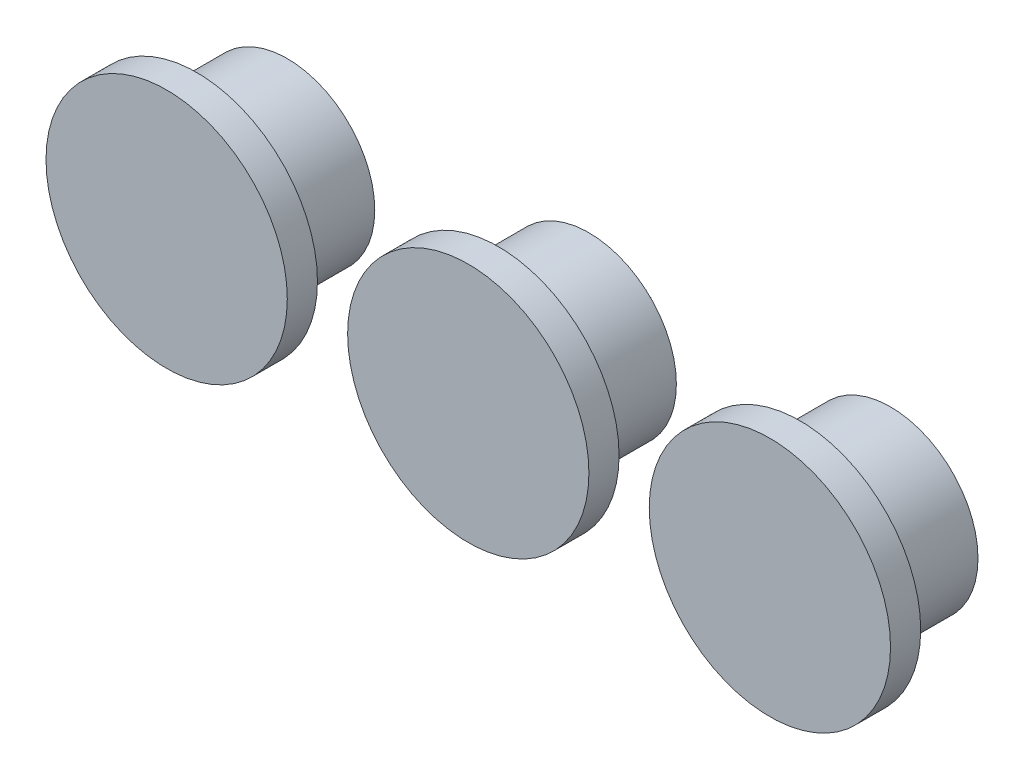
ISO-10303-21;
HEADER;
FILE_DESCRIPTION(('STEP AP214'),'2;1');
FILE_NAME('part.step','',(''),(''),'','','');
FILE_SCHEMA(('AUTOMOTIVE_DESIGN { 1 0 10303 214 1 1 1 1 }'));
ENDSEC;
DATA;
#1=APPLICATION_CONTEXT('core data for automotive mechanical design processes');
#2=APPLICATION_PROTOCOL_DEFINITION('international standard','automotive_design',2000,#1);
#3=PRODUCT_CONTEXT('',#1,'mechanical');
#4=PRODUCT('Part','Part','',(#3));
#5=PRODUCT_RELATED_PRODUCT_CATEGORY('part','',(#4));
#6=PRODUCT_DEFINITION_FORMATION('','',#4);
#7=PRODUCT_DEFINITION_CONTEXT('part definition',#1,'design');
#8=PRODUCT_DEFINITION('design','',#6,#7);
#9=PRODUCT_DEFINITION_SHAPE('','',#8);
#10=(LENGTH_UNIT() NAMED_UNIT(*) SI_UNIT(.MILLI.,.METRE.));
#11=(NAMED_UNIT(*) PLANE_ANGLE_UNIT() SI_UNIT($,.RADIAN.));
#12=(NAMED_UNIT(*) SI_UNIT($,.STERADIAN.) SOLID_ANGLE_UNIT());
#13=UNCERTAINTY_MEASURE_WITH_UNIT(LENGTH_MEASURE(1.E-05),#10,'distance_accuracy_value','');
#14=(GEOMETRIC_REPRESENTATION_CONTEXT(3) GLOBAL_UNCERTAINTY_ASSIGNED_CONTEXT((#13)) GLOBAL_UNIT_ASSIGNED_CONTEXT((#10,
#11,#12)) REPRESENTATION_CONTEXT('',''));
#15=CARTESIAN_POINT('',(0.,0.,0.));
#16=DIRECTION('',(0.,0.,1.));
#17=DIRECTION('',(1.,0.,0.));
#18=AXIS2_PLACEMENT_3D('',#15,#16,#17);
#19=CARTESIAN_POINT('',(-20.,0.,3.));
#20=DIRECTION('',(0.,0.,-1.));
#21=DIRECTION('',(-1.,0.,0.));
#22=AXIS2_PLACEMENT_3D('',#19,#20,#21);
#23=CYLINDRICAL_SURFACE('',#22,2.9);
#24=CARTESIAN_POINT('',(-20.,0.,3.));
#25=DIRECTION('',(0.,0.,1.));
#26=DIRECTION('',(1.,0.,0.));
#27=AXIS2_PLACEMENT_3D('',#24,#25,#26);
#28=CIRCLE('',#27,2.9);
#29=CARTESIAN_POINT('',(-17.1,0.,3.));
#30=VERTEX_POINT('',#29);
#31=EDGE_CURVE('E12',#30,#30,#28,.T.);
#32=ORIENTED_EDGE('',*,*,#31,.F.);
#33=EDGE_LOOP('',(#32));
#34=FACE_BOUND('',#33,.T.);
#35=CARTESIAN_POINT('',(-20.,0.,0.));
#36=DIRECTION('',(0.,0.,1.));
#37=DIRECTION('',(1.,0.,0.));
#38=AXIS2_PLACEMENT_3D('',#35,#36,#37);
#39=CIRCLE('',#38,2.9);
#40=CARTESIAN_POINT('',(-17.1,0.,0.));
#41=VERTEX_POINT('',#40);
#42=EDGE_CURVE('E47',#41,#41,#39,.T.);
#43=ORIENTED_EDGE('',*,*,#42,.T.);
#44=EDGE_LOOP('',(#43));
#45=FACE_BOUND('',#44,.T.);
#46=ADVANCED_FACE('F44',(#34,#45),#23,.T.);
#47=CARTESIAN_POINT('',(-20.,0.,0.));
#48=DIRECTION('',(0.,0.,1.));
#49=DIRECTION('',(1.,0.,0.));
#50=AXIS2_PLACEMENT_3D('',#47,#48,#49);
#51=PLANE('',#50);
#52=DIRECTION('',(-1.,0.,0.));
#53=VECTOR('',#52,1.);
#54=CARTESIAN_POINT('',(-18.8463310917722,0.363364072389241,0.));
#55=LINE('',#54,#53);
#56=CARTESIAN_POINT('',(-18.8463310917722,0.363364072389241,0.));
#57=VERTEX_POINT('',#56);
#58=CARTESIAN_POINT('',(-21.0999468453323,0.363364072389241,0.));
#59=VERTEX_POINT('',#58);
#60=EDGE_CURVE('E108',#57,#59,#55,.T.);
#61=ORIENTED_EDGE('',*,*,#60,.T.);
#62=DIRECTION('',(0.,-1.,0.));
#63=VECTOR('',#62,1.);
#64=CARTESIAN_POINT('',(-21.0999468453323,0.363364072389241,0.));
#65=LINE('',#64,#63);
#66=CARTESIAN_POINT('',(-21.0999468453323,-0.25125840585443,0.));
#67=VERTEX_POINT('',#66);
#68=EDGE_CURVE('E58',#59,#67,#65,.T.);
#69=ORIENTED_EDGE('',*,*,#68,.T.);
#70=DIRECTION('',(1.,0.,0.));
#71=VECTOR('',#70,1.);
#72=CARTESIAN_POINT('',(-21.0999468453323,-0.25125840585443,0.));
#73=LINE('',#72,#71);
#74=CARTESIAN_POINT('',(-18.8463310917722,-0.25125840585443,0.));
#75=VERTEX_POINT('',#74);
#76=EDGE_CURVE('E113',#67,#75,#73,.T.);
#77=ORIENTED_EDGE('',*,*,#76,.T.);
#78=DIRECTION('',(0.,1.,0.));
#79=VECTOR('',#78,1.);
#80=CARTESIAN_POINT('',(-18.8463310917722,-0.25125840585443,0.));
#81=LINE('',#80,#79);
#82=EDGE_CURVE('E96',#75,#57,#81,.T.);
#83=ORIENTED_EDGE('',*,*,#82,.T.);
#84=EDGE_LOOP('',(#61,#69,#77,#83));
#85=FACE_BOUND('',#84,.T.);
#86=ORIENTED_EDGE('',*,*,#42,.F.);
#87=EDGE_LOOP('',(#86));
#88=FACE_BOUND('',#87,.T.);
#89=ADVANCED_FACE('F146',(#85,#88),#51,.F.);
#90=CARTESIAN_POINT('',(-20.,0.,4.));
#91=DIRECTION('',(0.,0.,-1.));
#92=DIRECTION('',(-1.,0.,0.));
#93=AXIS2_PLACEMENT_3D('',#90,#91,#92);
#94=CYLINDRICAL_SURFACE('',#93,4.);
#95=CARTESIAN_POINT('',(-20.,0.,4.));
#96=DIRECTION('',(0.,0.,1.));
#97=DIRECTION('',(1.,0.,0.));
#98=AXIS2_PLACEMENT_3D('',#95,#96,#97);
#99=CIRCLE('',#98,4.);
#100=CARTESIAN_POINT('',(-16.,0.,4.));
#101=VERTEX_POINT('',#100);
#102=EDGE_CURVE('E122',#101,#101,#99,.T.);
#103=ORIENTED_EDGE('',*,*,#102,.F.);
#104=EDGE_LOOP('',(#103));
#105=FACE_BOUND('',#104,.T.);
#106=CARTESIAN_POINT('',(-20.,0.,3.));
#107=DIRECTION('',(0.,0.,1.));
#108=DIRECTION('',(1.,0.,0.));
#109=AXIS2_PLACEMENT_3D('',#106,#107,#108);
#110=CIRCLE('',#109,4.);
#111=CARTESIAN_POINT('',(-16.,0.,3.));
#112=VERTEX_POINT('',#111);
#113=EDGE_CURVE('E119',#112,#112,#110,.T.);
#114=ORIENTED_EDGE('',*,*,#113,.T.);
#115=EDGE_LOOP('',(#114));
#116=FACE_BOUND('',#115,.T.);
#117=ADVANCED_FACE('F128',(#105,#116),#94,.T.);
#118=CARTESIAN_POINT('',(-20.,0.,4.));
#119=DIRECTION('',(0.,0.,1.));
#120=DIRECTION('',(1.,0.,0.));
#121=AXIS2_PLACEMENT_3D('',#118,#119,#120);
#122=PLANE('',#121);
#123=ORIENTED_EDGE('',*,*,#102,.T.);
#124=EDGE_LOOP('',(#123));
#125=FACE_BOUND('',#124,.T.);
#126=ADVANCED_FACE('F133',(#125),#122,.T.);
#127=CARTESIAN_POINT('',(-20.,0.,3.));
#128=DIRECTION('',(0.,0.,1.));
#129=DIRECTION('',(1.,0.,0.));
#130=AXIS2_PLACEMENT_3D('',#127,#128,#129);
#131=PLANE('',#130);
#132=ORIENTED_EDGE('',*,*,#31,.T.);
#133=EDGE_LOOP('',(#132));
#134=FACE_BOUND('',#133,.T.);
#135=ORIENTED_EDGE('',*,*,#113,.F.);
#136=EDGE_LOOP('',(#135));
#137=FACE_BOUND('',#136,.T.);
#138=ADVANCED_FACE('F130',(#134,#137),#131,.F.);
#139=CARTESIAN_POINT('',(-21.0999468453323,0.363364072389241,-0.5));
#140=DIRECTION('',(-1.,0.,0.));
#141=DIRECTION('',(0.,0.,1.));
#142=AXIS2_PLACEMENT_3D('',#139,#140,#141);
#143=PLANE('',#142);
#144=ORIENTED_EDGE('',*,*,#68,.F.);
#145=DIRECTION('',(0.,0.,1.));
#146=VECTOR('',#145,1.);
#147=CARTESIAN_POINT('',(-21.0999468453323,0.363364072389241,-0.5));
#148=LINE('',#147,#146);
#149=CARTESIAN_POINT('',(-21.0999468453323,0.363364072389241,-0.5));
#150=VERTEX_POINT('',#149);
#151=EDGE_CURVE('E63',#150,#59,#148,.T.);
#152=ORIENTED_EDGE('',*,*,#151,.F.);
#153=DIRECTION('',(0.,-1.,0.));
#154=VECTOR('',#153,1.);
#155=CARTESIAN_POINT('',(-21.0999468453323,0.363364072389241,-0.5));
#156=LINE('',#155,#154);
#157=CARTESIAN_POINT('',(-21.0999468453323,-0.25125840585443,-0.5));
#158=VERTEX_POINT('',#157);
#159=EDGE_CURVE('E106',#150,#158,#156,.T.);
#160=ORIENTED_EDGE('',*,*,#159,.T.);
#161=DIRECTION('',(0.,0.,1.));
#162=VECTOR('',#161,1.);
#163=CARTESIAN_POINT('',(-21.0999468453323,-0.25125840585443,-0.5));
#164=LINE('',#163,#162);
#165=EDGE_CURVE('E87',#158,#67,#164,.T.);
#166=ORIENTED_EDGE('',*,*,#165,.T.);
#167=EDGE_LOOP('',(#144,#152,#160,#166));
#168=FACE_BOUND('',#167,.T.);
#169=ADVANCED_FACE('F132',(#168),#143,.T.);
#170=CARTESIAN_POINT('',(-18.8463310917722,0.363364072389241,-0.5));
#171=DIRECTION('',(0.,1.,0.));
#172=DIRECTION('',(0.,0.,1.));
#173=AXIS2_PLACEMENT_3D('',#170,#171,#172);
#174=PLANE('',#173);
#175=ORIENTED_EDGE('',*,*,#60,.F.);
#176=DIRECTION('',(0.,0.,1.));
#177=VECTOR('',#176,1.);
#178=CARTESIAN_POINT('',(-18.8463310917722,0.363364072389241,-0.5));
#179=LINE('',#178,#177);
#180=CARTESIAN_POINT('',(-18.8463310917722,0.363364072389241,-0.5));
#181=VERTEX_POINT('',#180);
#182=EDGE_CURVE('E80',#181,#57,#179,.T.);
#183=ORIENTED_EDGE('',*,*,#182,.F.);
#184=DIRECTION('',(-1.,0.,0.));
#185=VECTOR('',#184,1.);
#186=CARTESIAN_POINT('',(-18.8463310917722,0.363364072389241,-0.5));
#187=LINE('',#186,#185);
#188=EDGE_CURVE('E103',#181,#150,#187,.T.);
#189=ORIENTED_EDGE('',*,*,#188,.T.);
#190=ORIENTED_EDGE('',*,*,#151,.T.);
#191=EDGE_LOOP('',(#175,#183,#189,#190));
#192=FACE_BOUND('',#191,.T.);
#193=ADVANCED_FACE('F140',(#192),#174,.T.);
#194=CARTESIAN_POINT('',(-18.8463310917722,-0.25125840585443,-0.5));
#195=DIRECTION('',(1.,0.,0.));
#196=DIRECTION('',(0.,0.,-1.));
#197=AXIS2_PLACEMENT_3D('',#194,#195,#196);
#198=PLANE('',#197);
#199=ORIENTED_EDGE('',*,*,#82,.F.);
#200=DIRECTION('',(0.,0.,1.));
#201=VECTOR('',#200,1.);
#202=CARTESIAN_POINT('',(-18.8463310917722,-0.25125840585443,-0.5));
#203=LINE('',#202,#201);
#204=CARTESIAN_POINT('',(-18.8463310917722,-0.25125840585443,-0.5));
#205=VERTEX_POINT('',#204);
#206=EDGE_CURVE('E90',#205,#75,#203,.T.);
#207=ORIENTED_EDGE('',*,*,#206,.F.);
#208=DIRECTION('',(0.,1.,0.));
#209=VECTOR('',#208,1.);
#210=CARTESIAN_POINT('',(-18.8463310917722,-0.25125840585443,-0.5));
#211=LINE('',#210,#209);
#212=EDGE_CURVE('E93',#205,#181,#211,.T.);
#213=ORIENTED_EDGE('',*,*,#212,.T.);
#214=ORIENTED_EDGE('',*,*,#182,.T.);
#215=EDGE_LOOP('',(#199,#207,#213,#214));
#216=FACE_BOUND('',#215,.T.);
#217=ADVANCED_FACE('F92',(#216),#198,.T.);
#218=CARTESIAN_POINT('',(-21.0999468453323,-0.25125840585443,-0.5));
#219=DIRECTION('',(0.,-1.,0.));
#220=DIRECTION('',(0.,0.,-1.));
#221=AXIS2_PLACEMENT_3D('',#218,#219,#220);
#222=PLANE('',#221);
#223=ORIENTED_EDGE('',*,*,#76,.F.);
#224=ORIENTED_EDGE('',*,*,#165,.F.);
#225=DIRECTION('',(1.,0.,0.));
#226=VECTOR('',#225,1.);
#227=CARTESIAN_POINT('',(-21.0999468453323,-0.25125840585443,-0.5));
#228=LINE('',#227,#226);
#229=EDGE_CURVE('E101',#158,#205,#228,.T.);
#230=ORIENTED_EDGE('',*,*,#229,.T.);
#231=ORIENTED_EDGE('',*,*,#206,.T.);
#232=EDGE_LOOP('',(#223,#224,#230,#231));
#233=FACE_BOUND('',#232,.T.);
#234=ADVANCED_FACE('F105',(#233),#222,.T.);
#235=CARTESIAN_POINT('',(0.,0.,-0.5));
#236=DIRECTION('',(0.,0.,1.));
#237=DIRECTION('',(1.,0.,0.));
#238=AXIS2_PLACEMENT_3D('',#235,#236,#237);
#239=PLANE('',#238);
#240=ORIENTED_EDGE('',*,*,#159,.F.);
#241=ORIENTED_EDGE('',*,*,#188,.F.);
#242=ORIENTED_EDGE('',*,*,#212,.F.);
#243=ORIENTED_EDGE('',*,*,#229,.F.);
#244=EDGE_LOOP('',(#240,#241,#242,#243));
#245=FACE_BOUND('',#244,.T.);
#246=ADVANCED_FACE('F100',(#245),#239,.F.);
#247=CLOSED_SHELL('',(#46,#89,#117,#126,#138,#169,#193,#217,#234,#246));
#248=MANIFOLD_SOLID_BREP('B2',#247);
#249=CARTESIAN_POINT('',(-10.,0.,0.));
#250=DIRECTION('',(0.,0.,1.));
#251=DIRECTION('',(1.,0.,0.));
#252=AXIS2_PLACEMENT_3D('',#249,#250,#251);
#253=PLANE('',#252);
#254=CARTESIAN_POINT('',(-10.,0.,0.));
#255=DIRECTION('',(0.,0.,1.));
#256=DIRECTION('',(1.,0.,0.));
#257=AXIS2_PLACEMENT_3D('',#254,#255,#256);
#258=CIRCLE('',#257,2.9);
#259=CARTESIAN_POINT('',(-7.1,0.,0.));
#260=VERTEX_POINT('',#259);
#261=EDGE_CURVE('E241',#260,#260,#258,.T.);
#262=ORIENTED_EDGE('',*,*,#261,.F.);
#263=EDGE_LOOP('',(#262));
#264=FACE_BOUND('',#263,.T.);
#265=DIRECTION('',(0.,-1.,0.));
#266=VECTOR('',#265,1.);
#267=CARTESIAN_POINT('',(-8.44204611788897,1.55834461552597,0.));
#268=LINE('',#267,#266);
#269=CARTESIAN_POINT('',(-8.44204611788897,1.55834461552597,0.));
#270=VERTEX_POINT('',#269);
#271=CARTESIAN_POINT('',(-8.44204611788897,-1.44165538447403,0.));
#272=VERTEX_POINT('',#271);
#273=EDGE_CURVE('E252',#270,#272,#268,.T.);
#274=ORIENTED_EDGE('',*,*,#273,.F.);
#275=DIRECTION('',(1.,0.,0.));
#276=VECTOR('',#275,1.);
#277=CARTESIAN_POINT('',(-8.44204611788897,1.55834461552597,0.));
#278=LINE('',#277,#276);
#279=CARTESIAN_POINT('',(-11.442046117889,1.55834461552597,0.));
#280=VERTEX_POINT('',#279);
#281=EDGE_CURVE('E256',#280,#270,#278,.T.);
#282=ORIENTED_EDGE('',*,*,#281,.F.);
#283=DIRECTION('',(0.,1.,0.));
#284=VECTOR('',#283,1.);
#285=CARTESIAN_POINT('',(-11.442046117889,1.55834461552597,0.));
#286=LINE('',#285,#284);
#287=CARTESIAN_POINT('',(-11.442046117889,-1.44165538447403,0.));
#288=VERTEX_POINT('',#287);
#289=EDGE_CURVE('E405',#288,#280,#286,.T.);
#290=ORIENTED_EDGE('',*,*,#289,.F.);
#291=DIRECTION('',(-1.,0.,0.));
#292=VECTOR('',#291,1.);
#293=CARTESIAN_POINT('',(-8.44204611788897,-1.44165538447403,0.));
#294=LINE('',#293,#292);
#295=EDGE_CURVE('E411',#272,#288,#294,.T.);
#296=ORIENTED_EDGE('',*,*,#295,.F.);
#297=EDGE_LOOP('',(#274,#282,#290,#296));
#298=FACE_BOUND('',#297,.T.);
#299=ADVANCED_FACE('F237',(#264,#298),#253,.F.);
#300=CARTESIAN_POINT('',(-10.,0.,3.));
#301=DIRECTION('',(0.,0.,-1.));
#302=DIRECTION('',(-1.,0.,0.));
#303=AXIS2_PLACEMENT_3D('',#300,#301,#302);
#304=CYLINDRICAL_SURFACE('',#303,2.9);
#305=CARTESIAN_POINT('',(-10.,0.,3.));
#306=DIRECTION('',(0.,0.,1.));
#307=DIRECTION('',(1.,0.,0.));
#308=AXIS2_PLACEMENT_3D('',#305,#306,#307);
#309=CIRCLE('',#308,2.9);
#310=CARTESIAN_POINT('',(-7.1,0.,3.));
#311=VERTEX_POINT('',#310);
#312=EDGE_CURVE('E42',#311,#311,#309,.T.);
#313=ORIENTED_EDGE('',*,*,#312,.F.);
#314=EDGE_LOOP('',(#313));
#315=FACE_BOUND('',#314,.T.);
#316=ORIENTED_EDGE('',*,*,#261,.T.);
#317=EDGE_LOOP('',(#316));
#318=FACE_BOUND('',#317,.T.);
#319=ADVANCED_FACE('F239',(#315,#318),#304,.T.);
#320=CARTESIAN_POINT('',(-10.,0.,4.));
#321=DIRECTION('',(0.,0.,-1.));
#322=DIRECTION('',(-1.,0.,0.));
#323=AXIS2_PLACEMENT_3D('',#320,#321,#322);
#324=CYLINDRICAL_SURFACE('',#323,4.);
#325=CARTESIAN_POINT('',(-10.,0.,4.));
#326=DIRECTION('',(0.,0.,1.));
#327=DIRECTION('',(1.,0.,0.));
#328=AXIS2_PLACEMENT_3D('',#325,#326,#327);
#329=CIRCLE('',#328,4.);
#330=CARTESIAN_POINT('',(-6.,0.,4.));
#331=VERTEX_POINT('',#330);
#332=EDGE_CURVE('E301',#331,#331,#329,.T.);
#333=ORIENTED_EDGE('',*,*,#332,.F.);
#334=EDGE_LOOP('',(#333));
#335=FACE_BOUND('',#334,.T.);
#336=CARTESIAN_POINT('',(-10.,0.,3.));
#337=DIRECTION('',(0.,0.,1.));
#338=DIRECTION('',(1.,0.,0.));
#339=AXIS2_PLACEMENT_3D('',#336,#337,#338);
#340=CIRCLE('',#339,4.);
#341=CARTESIAN_POINT('',(-6.,0.,3.));
#342=VERTEX_POINT('',#341);
#343=EDGE_CURVE('E298',#342,#342,#340,.T.);
#344=ORIENTED_EDGE('',*,*,#343,.T.);
#345=EDGE_LOOP('',(#344));
#346=FACE_BOUND('',#345,.T.);
#347=ADVANCED_FACE('F320',(#335,#346),#324,.T.);
#348=CARTESIAN_POINT('',(-10.,0.,4.));
#349=DIRECTION('',(0.,0.,1.));
#350=DIRECTION('',(1.,0.,0.));
#351=AXIS2_PLACEMENT_3D('',#348,#349,#350);
#352=PLANE('',#351);
#353=ORIENTED_EDGE('',*,*,#332,.T.);
#354=EDGE_LOOP('',(#353));
#355=FACE_BOUND('',#354,.T.);
#356=ADVANCED_FACE('F325',(#355),#352,.T.);
#357=CARTESIAN_POINT('',(-10.,0.,3.));
#358=DIRECTION('',(0.,0.,1.));
#359=DIRECTION('',(1.,0.,0.));
#360=AXIS2_PLACEMENT_3D('',#357,#358,#359);
#361=PLANE('',#360);
#362=ORIENTED_EDGE('',*,*,#312,.T.);
#363=EDGE_LOOP('',(#362));
#364=FACE_BOUND('',#363,.T.);
#365=ORIENTED_EDGE('',*,*,#343,.F.);
#366=EDGE_LOOP('',(#365));
#367=FACE_BOUND('',#366,.T.);
#368=ADVANCED_FACE('F327',(#364,#367),#361,.F.);
#369=CARTESIAN_POINT('',(-8.44204611788897,1.55834461552597,-0.5));
#370=DIRECTION('',(-1.,0.,0.));
#371=DIRECTION('',(0.,0.,1.));
#372=AXIS2_PLACEMENT_3D('',#369,#370,#371);
#373=PLANE('',#372);
#374=ORIENTED_EDGE('',*,*,#273,.T.);
#375=DIRECTION('',(0.,0.,1.));
#376=VECTOR('',#375,1.);
#377=CARTESIAN_POINT('',(-8.44204611788897,-1.44165538447403,-0.5));
#378=LINE('',#377,#376);
#379=CARTESIAN_POINT('',(-8.44204611788897,-1.44165538447403,-0.5));
#380=VERTEX_POINT('',#379);
#381=EDGE_CURVE('E281',#380,#272,#378,.T.);
#382=ORIENTED_EDGE('',*,*,#381,.F.);
#383=DIRECTION('',(0.,-1.,0.));
#384=VECTOR('',#383,1.);
#385=CARTESIAN_POINT('',(-8.44204611788897,1.55834461552597,-0.5));
#386=LINE('',#385,#384);
#387=CARTESIAN_POINT('',(-8.44204611788897,1.55834461552597,-0.5));
#388=VERTEX_POINT('',#387);
#389=EDGE_CURVE('E287',#388,#380,#386,.T.);
#390=ORIENTED_EDGE('',*,*,#389,.F.);
#391=DIRECTION('',(0.,0.,1.));
#392=VECTOR('',#391,1.);
#393=CARTESIAN_POINT('',(-8.44204611788897,1.55834461552597,-0.5));
#394=LINE('',#393,#392);
#395=EDGE_CURVE('E403',#388,#270,#394,.T.);
#396=ORIENTED_EDGE('',*,*,#395,.T.);
#397=EDGE_LOOP('',(#374,#382,#390,#396));
#398=FACE_BOUND('',#397,.T.);
#399=ADVANCED_FACE('F297',(#398),#373,.F.);
#400=CARTESIAN_POINT('',(-8.44204611788897,-1.44165538447403,-0.5));
#401=DIRECTION('',(0.,1.,0.));
#402=DIRECTION('',(0.,0.,1.));
#403=AXIS2_PLACEMENT_3D('',#400,#401,#402);
#404=PLANE('',#403);
#405=ORIENTED_EDGE('',*,*,#295,.T.);
#406=DIRECTION('',(0.,0.,1.));
#407=VECTOR('',#406,1.);
#408=CARTESIAN_POINT('',(-11.442046117889,-1.44165538447403,-0.5));
#409=LINE('',#408,#407);
#410=CARTESIAN_POINT('',(-11.442046117889,-1.44165538447403,-0.5));
#411=VERTEX_POINT('',#410);
#412=EDGE_CURVE('E283',#411,#288,#409,.T.);
#413=ORIENTED_EDGE('',*,*,#412,.F.);
#414=DIRECTION('',(-1.,0.,0.));
#415=VECTOR('',#414,1.);
#416=CARTESIAN_POINT('',(-8.44204611788897,-1.44165538447403,-0.5));
#417=LINE('',#416,#415);
#418=EDGE_CURVE('E276',#380,#411,#417,.T.);
#419=ORIENTED_EDGE('',*,*,#418,.F.);
#420=ORIENTED_EDGE('',*,*,#381,.T.);
#421=EDGE_LOOP('',(#405,#413,#419,#420));
#422=FACE_BOUND('',#421,.T.);
#423=ADVANCED_FACE('F279',(#422),#404,.F.);
#424=CARTESIAN_POINT('',(-11.442046117889,1.55834461552597,-0.5));
#425=DIRECTION('',(1.,0.,0.));
#426=DIRECTION('',(0.,0.,-1.));
#427=AXIS2_PLACEMENT_3D('',#424,#425,#426);
#428=PLANE('',#427);
#429=ORIENTED_EDGE('',*,*,#289,.T.);
#430=DIRECTION('',(0.,0.,1.));
#431=VECTOR('',#430,1.);
#432=CARTESIAN_POINT('',(-11.442046117889,1.55834461552597,-0.5));
#433=LINE('',#432,#431);
#434=CARTESIAN_POINT('',(-11.442046117889,1.55834461552597,-0.5));
#435=VERTEX_POINT('',#434);
#436=EDGE_CURVE('E303',#435,#280,#433,.T.);
#437=ORIENTED_EDGE('',*,*,#436,.F.);
#438=DIRECTION('',(0.,1.,0.));
#439=VECTOR('',#438,1.);
#440=CARTESIAN_POINT('',(-11.442046117889,1.55834461552597,-0.5));
#441=LINE('',#440,#439);
#442=EDGE_CURVE('E286',#411,#435,#441,.T.);
#443=ORIENTED_EDGE('',*,*,#442,.F.);
#444=ORIENTED_EDGE('',*,*,#412,.T.);
#445=EDGE_LOOP('',(#429,#437,#443,#444));
#446=FACE_BOUND('',#445,.T.);
#447=ADVANCED_FACE('F337',(#446),#428,.F.);
#448=CARTESIAN_POINT('',(-8.44204611788897,1.55834461552597,-0.5));
#449=DIRECTION('',(0.,-1.,0.));
#450=DIRECTION('',(0.,0.,-1.));
#451=AXIS2_PLACEMENT_3D('',#448,#449,#450);
#452=PLANE('',#451);
#453=ORIENTED_EDGE('',*,*,#281,.T.);
#454=ORIENTED_EDGE('',*,*,#395,.F.);
#455=DIRECTION('',(1.,0.,0.));
#456=VECTOR('',#455,1.);
#457=CARTESIAN_POINT('',(-8.44204611788897,1.55834461552597,-0.5));
#458=LINE('',#457,#456);
#459=EDGE_CURVE('E292',#435,#388,#458,.T.);
#460=ORIENTED_EDGE('',*,*,#459,.F.);
#461=ORIENTED_EDGE('',*,*,#436,.T.);
#462=EDGE_LOOP('',(#453,#454,#460,#461));
#463=FACE_BOUND('',#462,.T.);
#464=ADVANCED_FACE('F340',(#463),#452,.F.);
#465=CARTESIAN_POINT('',(0.,0.,-0.5));
#466=DIRECTION('',(0.,0.,-1.));
#467=DIRECTION('',(-1.,0.,0.));
#468=AXIS2_PLACEMENT_3D('',#465,#466,#467);
#469=PLANE('',#468);
#470=ORIENTED_EDGE('',*,*,#389,.T.);
#471=ORIENTED_EDGE('',*,*,#418,.T.);
#472=ORIENTED_EDGE('',*,*,#442,.T.);
#473=ORIENTED_EDGE('',*,*,#459,.T.);
#474=EDGE_LOOP('',(#470,#471,#472,#473));
#475=FACE_BOUND('',#474,.T.);
#476=ADVANCED_FACE('F290',(#475),#469,.T.);
#477=CLOSED_SHELL('',(#299,#319,#347,#356,#368,#399,#423,#447,#464,#476));
#478=MANIFOLD_SOLID_BREP('B6',#477);
#479=CARTESIAN_POINT('',(0.,0.,3.));
#480=DIRECTION('',(0.,0.,-1.));
#481=DIRECTION('',(-1.,0.,0.));
#482=AXIS2_PLACEMENT_3D('',#479,#480,#481);
#483=CYLINDRICAL_SURFACE('',#482,2.9);
#484=CARTESIAN_POINT('',(0.,0.,3.));
#485=DIRECTION('',(0.,0.,1.));
#486=DIRECTION('',(1.,0.,0.));
#487=AXIS2_PLACEMENT_3D('',#484,#485,#486);
#488=CIRCLE('',#487,2.9);
#489=CARTESIAN_POINT('',(2.9,0.,3.));
#490=VERTEX_POINT('',#489);
#491=EDGE_CURVE('E235',#490,#490,#488,.T.);
#492=ORIENTED_EDGE('',*,*,#491,.F.);
#493=EDGE_LOOP('',(#492));
#494=FACE_BOUND('',#493,.T.);
#495=CARTESIAN_POINT('',(0.,0.,0.));
#496=DIRECTION('',(0.,0.,1.));
#497=DIRECTION('',(1.,0.,0.));
#498=AXIS2_PLACEMENT_3D('',#495,#496,#497);
#499=CIRCLE('',#498,2.9);
#500=CARTESIAN_POINT('',(2.9,0.,0.));
#501=VERTEX_POINT('',#500);
#502=EDGE_CURVE('E424',#501,#501,#499,.T.);
#503=ORIENTED_EDGE('',*,*,#502,.T.);
#504=EDGE_LOOP('',(#503));
#505=FACE_BOUND('',#504,.T.);
#506=ADVANCED_FACE('F421',(#494,#505),#483,.T.);
#507=CARTESIAN_POINT('',(0.,0.,0.));
#508=DIRECTION('',(0.,0.,1.));
#509=DIRECTION('',(1.,0.,0.));
#510=AXIS2_PLACEMENT_3D('',#507,#508,#509);
#511=PLANE('',#510);
#512=DIRECTION('',(-1.,0.,0.));
#513=VECTOR('',#512,1.);
#514=CARTESIAN_POINT('',(-0.362539264212914,0.189310936347937,0.));
#515=LINE('',#514,#513);
#516=CARTESIAN_POINT('',(-0.362539264212914,0.189310936347937,0.));
#517=VERTEX_POINT('',#516);
#518=CARTESIAN_POINT('',(-2.34298947188696,0.189310936347937,0.));
#519=VERTEX_POINT('',#518);
#520=EDGE_CURVE('E573',#517,#519,#515,.T.);
#521=ORIENTED_EDGE('',*,*,#520,.T.);
#522=DIRECTION('',(0.,-1.,0.));
#523=VECTOR('',#522,1.);
#524=CARTESIAN_POINT('',(-2.34298947188696,0.189310936347937,0.));
#525=LINE('',#524,#523);
#526=CARTESIAN_POINT('',(-2.34298947188696,-0.357020155424215,0.));
#527=VERTEX_POINT('',#526);
#528=EDGE_CURVE('E435',#519,#527,#525,.T.);
#529=ORIENTED_EDGE('',*,*,#528,.T.);
#530=DIRECTION('',(1.,0.,0.));
#531=VECTOR('',#530,1.);
#532=CARTESIAN_POINT('',(-2.34298947188696,-0.357020155424215,0.));
#533=LINE('',#532,#531);
#534=CARTESIAN_POINT('',(-0.362539264212914,-0.357020155424215,0.));
#535=VERTEX_POINT('',#534);
#536=EDGE_CURVE('E546',#527,#535,#533,.T.);
#537=ORIENTED_EDGE('',*,*,#536,.T.);
#538=DIRECTION('',(0.,-1.,0.));
#539=VECTOR('',#538,1.);
#540=CARTESIAN_POINT('',(-0.362539264212914,-0.357020155424215,0.));
#541=LINE('',#540,#539);
#542=CARTESIAN_POINT('',(-0.362539264212914,-2.33747036309827,0.));
#543=VERTEX_POINT('',#542);
#544=EDGE_CURVE('E549',#535,#543,#541,.T.);
#545=ORIENTED_EDGE('',*,*,#544,.T.);
#546=DIRECTION('',(1.,0.,0.));
#547=VECTOR('',#546,1.);
#548=CARTESIAN_POINT('',(-0.362539264212914,-2.33747036309827,0.));
#549=LINE('',#548,#547);
#550=CARTESIAN_POINT('',(0.252083214030757,-2.33747036309827,0.));
#551=VERTEX_POINT('',#550);
#552=EDGE_CURVE('E552',#543,#551,#549,.T.);
#553=ORIENTED_EDGE('',*,*,#552,.T.);
#554=DIRECTION('',(0.,1.,0.));
#555=VECTOR('',#554,1.);
#556=CARTESIAN_POINT('',(0.252083214030757,-2.33747036309827,0.));
#557=LINE('',#556,#555);
#558=CARTESIAN_POINT('',(0.252083214030757,-0.357020155424215,0.));
#559=VERTEX_POINT('',#558);
#560=EDGE_CURVE('E555',#551,#559,#557,.T.);
#561=ORIENTED_EDGE('',*,*,#560,.T.);
#562=DIRECTION('',(1.,0.,0.));
#563=VECTOR('',#562,1.);
#564=CARTESIAN_POINT('',(0.252083214030757,-0.357020155424215,0.));
#565=LINE('',#564,#563);
#566=CARTESIAN_POINT('',(2.23253342170481,-0.357020155424215,0.));
#567=VERTEX_POINT('',#566);
#568=EDGE_CURVE('E558',#559,#567,#565,.T.);
#569=ORIENTED_EDGE('',*,*,#568,.T.);
#570=DIRECTION('',(0.,1.,0.));
#571=VECTOR('',#570,1.);
#572=CARTESIAN_POINT('',(2.23253342170481,-0.357020155424215,0.));
#573=LINE('',#572,#571);
#574=CARTESIAN_POINT('',(2.23253342170481,0.189310936347937,0.));
#575=VERTEX_POINT('',#574);
#576=EDGE_CURVE('E561',#567,#575,#573,.T.);
#577=ORIENTED_EDGE('',*,*,#576,.T.);
#578=DIRECTION('',(-1.,0.,0.));
#579=VECTOR('',#578,1.);
#580=CARTESIAN_POINT('',(2.23253342170481,0.189310936347937,0.));
#581=LINE('',#580,#579);
#582=CARTESIAN_POINT('',(0.252083214030757,0.189310936347937,0.));
#583=VERTEX_POINT('',#582);
#584=EDGE_CURVE('E564',#575,#583,#581,.T.);
#585=ORIENTED_EDGE('',*,*,#584,.T.);
#586=DIRECTION('',(0.,1.,0.));
#587=VECTOR('',#586,1.);
#588=CARTESIAN_POINT('',(0.252083214030757,0.189310936347937,0.));
#589=LINE('',#588,#587);
#590=CARTESIAN_POINT('',(0.252083214030757,2.16976114402199,0.));
#591=VERTEX_POINT('',#590);
#592=EDGE_CURVE('E567',#583,#591,#589,.T.);
#593=ORIENTED_EDGE('',*,*,#592,.T.);
#594=DIRECTION('',(-1.,0.,0.));
#595=VECTOR('',#594,1.);
#596=CARTESIAN_POINT('',(0.252083214030757,2.16976114402199,0.));
#597=LINE('',#596,#595);
#598=CARTESIAN_POINT('',(-0.362539264212914,2.16976114402199,0.));
#599=VERTEX_POINT('',#598);
#600=EDGE_CURVE('E570',#591,#599,#597,.T.);
#601=ORIENTED_EDGE('',*,*,#600,.T.);
#602=DIRECTION('',(0.,-1.,0.));
#603=VECTOR('',#602,1.);
#604=CARTESIAN_POINT('',(-0.362539264212914,2.16976114402199,0.));
#605=LINE('',#604,#603);
#606=EDGE_CURVE('E521',#599,#517,#605,.T.);
#607=ORIENTED_EDGE('',*,*,#606,.T.);
#608=EDGE_LOOP('',(#521,#529,#537,#545,#553,#561,#569,#577,#585,#593,#601,#607));
#609=FACE_BOUND('',#608,.T.);
#610=ORIENTED_EDGE('',*,*,#502,.F.);
#611=EDGE_LOOP('',(#610));
#612=FACE_BOUND('',#611,.T.);
#613=ADVANCED_FACE('F620',(#609,#612),#511,.F.);
#614=CARTESIAN_POINT('',(0.,0.,4.));
#615=DIRECTION('',(0.,0.,-1.));
#616=DIRECTION('',(-1.,0.,0.));
#617=AXIS2_PLACEMENT_3D('',#614,#615,#616);
#618=CYLINDRICAL_SURFACE('',#617,4.);
#619=CARTESIAN_POINT('',(0.,0.,4.));
#620=DIRECTION('',(0.,0.,1.));
#621=DIRECTION('',(1.,0.,0.));
#622=AXIS2_PLACEMENT_3D('',#619,#620,#621);
#623=CIRCLE('',#622,4.);
#624=CARTESIAN_POINT('',(4.,0.,4.));
#625=VERTEX_POINT('',#624);
#626=EDGE_CURVE('E596',#625,#625,#623,.T.);
#627=ORIENTED_EDGE('',*,*,#626,.F.);
#628=EDGE_LOOP('',(#627));
#629=FACE_BOUND('',#628,.T.);
#630=CARTESIAN_POINT('',(0.,0.,3.));
#631=DIRECTION('',(0.,0.,1.));
#632=DIRECTION('',(1.,0.,0.));
#633=AXIS2_PLACEMENT_3D('',#630,#631,#632);
#634=CIRCLE('',#633,4.);
#635=CARTESIAN_POINT('',(4.,0.,3.));
#636=VERTEX_POINT('',#635);
#637=EDGE_CURVE('E578',#636,#636,#634,.T.);
#638=ORIENTED_EDGE('',*,*,#637,.T.);
#639=EDGE_LOOP('',(#638));
#640=FACE_BOUND('',#639,.T.);
#641=ADVANCED_FACE('F602',(#629,#640),#618,.T.);
#642=CARTESIAN_POINT('',(0.,0.,4.));
#643=DIRECTION('',(0.,0.,1.));
#644=DIRECTION('',(1.,0.,0.));
#645=AXIS2_PLACEMENT_3D('',#642,#643,#644);
#646=PLANE('',#645);
#647=ORIENTED_EDGE('',*,*,#626,.T.);
#648=EDGE_LOOP('',(#647));
#649=FACE_BOUND('',#648,.T.);
#650=ADVANCED_FACE('F607',(#649),#646,.T.);
#651=CARTESIAN_POINT('',(0.,0.,3.));
#652=DIRECTION('',(0.,0.,1.));
#653=DIRECTION('',(1.,0.,0.));
#654=AXIS2_PLACEMENT_3D('',#651,#652,#653);
#655=PLANE('',#654);
#656=ORIENTED_EDGE('',*,*,#491,.T.);
#657=EDGE_LOOP('',(#656));
#658=FACE_BOUND('',#657,.T.);
#659=ORIENTED_EDGE('',*,*,#637,.F.);
#660=EDGE_LOOP('',(#659));
#661=FACE_BOUND('',#660,.T.);
#662=ADVANCED_FACE('F604',(#658,#661),#655,.F.);
#663=CARTESIAN_POINT('',(-2.34298947188696,0.189310936347937,-0.5));
#664=DIRECTION('',(-1.,0.,0.));
#665=DIRECTION('',(0.,0.,1.));
#666=AXIS2_PLACEMENT_3D('',#663,#664,#665);
#667=PLANE('',#666);
#668=ORIENTED_EDGE('',*,*,#528,.F.);
#669=DIRECTION('',(0.,0.,1.));
#670=VECTOR('',#669,1.);
#671=CARTESIAN_POINT('',(-2.34298947188696,0.189310936347937,-0.5));
#672=LINE('',#671,#670);
#673=CARTESIAN_POINT('',(-2.34298947188696,0.189310936347937,-0.5));
#674=VERTEX_POINT('',#673);
#675=EDGE_CURVE('E440',#674,#519,#672,.T.);
#676=ORIENTED_EDGE('',*,*,#675,.F.);
#677=DIRECTION('',(0.,-1.,0.));
#678=VECTOR('',#677,1.);
#679=CARTESIAN_POINT('',(-2.34298947188696,0.189310936347937,-0.5));
#680=LINE('',#679,#678);
#681=CARTESIAN_POINT('',(-2.34298947188696,-0.357020155424215,-0.5));
#682=VERTEX_POINT('',#681);
#683=EDGE_CURVE('E576',#674,#682,#680,.T.);
#684=ORIENTED_EDGE('',*,*,#683,.T.);
#685=DIRECTION('',(0.,0.,1.));
#686=VECTOR('',#685,1.);
#687=CARTESIAN_POINT('',(-2.34298947188696,-0.357020155424215,-0.5));
#688=LINE('',#687,#686);
#689=EDGE_CURVE('E489',#682,#527,#688,.T.);
#690=ORIENTED_EDGE('',*,*,#689,.T.);
#691=EDGE_LOOP('',(#668,#676,#684,#690));
#692=FACE_BOUND('',#691,.T.);
#693=ADVANCED_FACE('F606',(#692),#667,.T.);
#694=CARTESIAN_POINT('',(-0.362539264212914,0.189310936347937,-0.5));
#695=DIRECTION('',(0.,1.,0.));
#696=DIRECTION('',(0.,0.,1.));
#697=AXIS2_PLACEMENT_3D('',#694,#695,#696);
#698=PLANE('',#697);
#699=ORIENTED_EDGE('',*,*,#520,.F.);
#700=DIRECTION('',(0.,0.,1.));
#701=VECTOR('',#700,1.);
#702=CARTESIAN_POINT('',(-0.362539264212914,0.189310936347937,-0.5));
#703=LINE('',#702,#701);
#704=CARTESIAN_POINT('',(-0.362539264212914,0.189310936347937,-0.5));
#705=VERTEX_POINT('',#704);
#706=EDGE_CURVE('E481',#705,#517,#703,.T.);
#707=ORIENTED_EDGE('',*,*,#706,.F.);
#708=DIRECTION('',(-1.,0.,0.));
#709=VECTOR('',#708,1.);
#710=CARTESIAN_POINT('',(-0.362539264212914,0.189310936347937,-0.5));
#711=LINE('',#710,#709);
#712=EDGE_CURVE('E535',#705,#674,#711,.T.);
#713=ORIENTED_EDGE('',*,*,#712,.T.);
#714=ORIENTED_EDGE('',*,*,#675,.T.);
#715=EDGE_LOOP('',(#699,#707,#713,#714));
#716=FACE_BOUND('',#715,.T.);
#717=ADVANCED_FACE('F614',(#716),#698,.T.);
#718=CARTESIAN_POINT('',(-0.362539264212914,2.16976114402199,-0.5));
#719=DIRECTION('',(-1.,0.,0.));
#720=DIRECTION('',(0.,0.,1.));
#721=AXIS2_PLACEMENT_3D('',#718,#719,#720);
#722=PLANE('',#721);
#723=ORIENTED_EDGE('',*,*,#606,.F.);
#724=DIRECTION('',(0.,0.,1.));
#725=VECTOR('',#724,1.);
#726=CARTESIAN_POINT('',(-0.362539264212914,2.16976114402199,-0.5));
#727=LINE('',#726,#725);
#728=CARTESIAN_POINT('',(-0.362539264212914,2.16976114402199,-0.5));
#729=VERTEX_POINT('',#728);
#730=EDGE_CURVE('E515',#729,#599,#727,.T.);
#731=ORIENTED_EDGE('',*,*,#730,.F.);
#732=DIRECTION('',(0.,-1.,0.));
#733=VECTOR('',#732,1.);
#734=CARTESIAN_POINT('',(-0.362539264212914,2.16976114402199,-0.5));
#735=LINE('',#734,#733);
#736=EDGE_CURVE('E518',#729,#705,#735,.T.);
#737=ORIENTED_EDGE('',*,*,#736,.T.);
#738=ORIENTED_EDGE('',*,*,#706,.T.);
#739=EDGE_LOOP('',(#723,#731,#737,#738));
#740=FACE_BOUND('',#739,.T.);
#741=ADVANCED_FACE('F517',(#740),#722,.T.);
#742=CARTESIAN_POINT('',(0.252083214030757,2.16976114402199,-0.5));
#743=DIRECTION('',(0.,1.,0.));
#744=DIRECTION('',(0.,0.,1.));
#745=AXIS2_PLACEMENT_3D('',#742,#743,#744);
#746=PLANE('',#745);
#747=ORIENTED_EDGE('',*,*,#600,.F.);
#748=DIRECTION('',(0.,0.,1.));
#749=VECTOR('',#748,1.);
#750=CARTESIAN_POINT('',(0.252083214030757,2.16976114402199,-0.5));
#751=LINE('',#750,#749);
#752=CARTESIAN_POINT('',(0.252083214030757,2.16976114402199,-0.5));
#753=VERTEX_POINT('',#752);
#754=EDGE_CURVE('E526',#753,#591,#751,.T.);
#755=ORIENTED_EDGE('',*,*,#754,.F.);
#756=DIRECTION('',(-1.,0.,0.));
#757=VECTOR('',#756,1.);
#758=CARTESIAN_POINT('',(0.252083214030757,2.16976114402199,-0.5));
#759=LINE('',#758,#757);
#760=EDGE_CURVE('E532',#753,#729,#759,.T.);
#761=ORIENTED_EDGE('',*,*,#760,.T.);
#762=ORIENTED_EDGE('',*,*,#730,.T.);
#763=EDGE_LOOP('',(#747,#755,#761,#762));
#764=FACE_BOUND('',#763,.T.);
#765=ADVANCED_FACE('F537',(#764),#746,.T.);
#766=CARTESIAN_POINT('',(0.252083214030757,0.189310936347937,-0.5));
#767=DIRECTION('',(1.,0.,0.));
#768=DIRECTION('',(0.,0.,-1.));
#769=AXIS2_PLACEMENT_3D('',#766,#767,#768);
#770=PLANE('',#769);
#771=ORIENTED_EDGE('',*,*,#592,.F.);
#772=DIRECTION('',(0.,0.,1.));
#773=VECTOR('',#772,1.);
#774=CARTESIAN_POINT('',(0.252083214030757,0.189310936347937,-0.5));
#775=LINE('',#774,#773);
#776=CARTESIAN_POINT('',(0.252083214030757,0.189310936347937,-0.5));
#777=VERTEX_POINT('',#776);
#778=EDGE_CURVE('E581',#777,#583,#775,.T.);
#779=ORIENTED_EDGE('',*,*,#778,.F.);
#780=DIRECTION('',(0.,1.,0.));
#781=VECTOR('',#780,1.);
#782=CARTESIAN_POINT('',(0.252083214030757,0.189310936347937,-0.5));
#783=LINE('',#782,#781);
#784=EDGE_CURVE('E538',#777,#753,#783,.T.);
#785=ORIENTED_EDGE('',*,*,#784,.T.);
#786=ORIENTED_EDGE('',*,*,#754,.T.);
#787=EDGE_LOOP('',(#771,#779,#785,#786));
#788=FACE_BOUND('',#787,.T.);
#789=ADVANCED_FACE('F647',(#788),#770,.T.);
#790=CARTESIAN_POINT('',(2.23253342170481,0.189310936347937,-0.5));
#791=DIRECTION('',(0.,1.,0.));
#792=DIRECTION('',(0.,0.,1.));
#793=AXIS2_PLACEMENT_3D('',#790,#791,#792);
#794=PLANE('',#793);
#795=ORIENTED_EDGE('',*,*,#584,.F.);
#796=DIRECTION('',(0.,0.,1.));
#797=VECTOR('',#796,1.);
#798=CARTESIAN_POINT('',(2.23253342170481,0.189310936347937,-0.5));
#799=LINE('',#798,#797);
#800=CARTESIAN_POINT('',(2.23253342170481,0.189310936347937,-0.5));
#801=VERTEX_POINT('',#800);
#802=EDGE_CURVE('E583',#801,#575,#799,.T.);
#803=ORIENTED_EDGE('',*,*,#802,.F.);
#804=DIRECTION('',(-1.,0.,0.));
#805=VECTOR('',#804,1.);
#806=CARTESIAN_POINT('',(2.23253342170481,0.189310936347937,-0.5));
#807=LINE('',#806,#805);
#808=EDGE_CURVE('E540',#801,#777,#807,.T.);
#809=ORIENTED_EDGE('',*,*,#808,.T.);
#810=ORIENTED_EDGE('',*,*,#778,.T.);
#811=EDGE_LOOP('',(#795,#803,#809,#810));
#812=FACE_BOUND('',#811,.T.);
#813=ADVANCED_FACE('F650',(#812),#794,.T.);
#814=CARTESIAN_POINT('',(2.23253342170481,-0.357020155424215,-0.5));
#815=DIRECTION('',(1.,0.,0.));
#816=DIRECTION('',(0.,0.,-1.));
#817=AXIS2_PLACEMENT_3D('',#814,#815,#816);
#818=PLANE('',#817);
#819=ORIENTED_EDGE('',*,*,#576,.F.);
#820=DIRECTION('',(0.,0.,1.));
#821=VECTOR('',#820,1.);
#822=CARTESIAN_POINT('',(2.23253342170481,-0.357020155424215,-0.5));
#823=LINE('',#822,#821);
#824=CARTESIAN_POINT('',(2.23253342170481,-0.357020155424215,-0.5));
#825=VERTEX_POINT('',#824);
#826=EDGE_CURVE('E585',#825,#567,#823,.T.);
#827=ORIENTED_EDGE('',*,*,#826,.F.);
#828=DIRECTION('',(0.,1.,0.));
#829=VECTOR('',#828,1.);
#830=CARTESIAN_POINT('',(2.23253342170481,-0.357020155424215,-0.5));
#831=LINE('',#830,#829);
#832=EDGE_CURVE('E699',#825,#801,#831,.T.);
#833=ORIENTED_EDGE('',*,*,#832,.T.);
#834=ORIENTED_EDGE('',*,*,#802,.T.);
#835=EDGE_LOOP('',(#819,#827,#833,#834));
#836=FACE_BOUND('',#835,.T.);
#837=ADVANCED_FACE('F654',(#836),#818,.T.);
#838=CARTESIAN_POINT('',(0.252083214030757,-0.357020155424215,-0.5));
#839=DIRECTION('',(0.,-1.,0.));
#840=DIRECTION('',(0.,0.,-1.));
#841=AXIS2_PLACEMENT_3D('',#838,#839,#840);
#842=PLANE('',#841);
#843=ORIENTED_EDGE('',*,*,#568,.F.);
#844=DIRECTION('',(0.,0.,1.));
#845=VECTOR('',#844,1.);
#846=CARTESIAN_POINT('',(0.252083214030757,-0.357020155424215,-0.5));
#847=LINE('',#846,#845);
#848=CARTESIAN_POINT('',(0.252083214030757,-0.357020155424215,-0.5));
#849=VERTEX_POINT('',#848);
#850=EDGE_CURVE('E587',#849,#559,#847,.T.);
#851=ORIENTED_EDGE('',*,*,#850,.F.);
#852=DIRECTION('',(1.,0.,0.));
#853=VECTOR('',#852,1.);
#854=CARTESIAN_POINT('',(0.252083214030757,-0.357020155424215,-0.5));
#855=LINE('',#854,#853);
#856=EDGE_CURVE('E695',#849,#825,#855,.T.);
#857=ORIENTED_EDGE('',*,*,#856,.T.);
#858=ORIENTED_EDGE('',*,*,#826,.T.);
#859=EDGE_LOOP('',(#843,#851,#857,#858));
#860=FACE_BOUND('',#859,.T.);
#861=ADVANCED_FACE('F658',(#860),#842,.T.);
#862=CARTESIAN_POINT('',(0.252083214030757,-2.33747036309827,-0.5));
#863=DIRECTION('',(1.,0.,0.));
#864=DIRECTION('',(0.,0.,-1.));
#865=AXIS2_PLACEMENT_3D('',#862,#863,#864);
#866=PLANE('',#865);
#867=ORIENTED_EDGE('',*,*,#560,.F.);
#868=DIRECTION('',(0.,0.,1.));
#869=VECTOR('',#868,1.);
#870=CARTESIAN_POINT('',(0.252083214030757,-2.33747036309827,-0.5));
#871=LINE('',#870,#869);
#872=CARTESIAN_POINT('',(0.252083214030757,-2.33747036309827,-0.5));
#873=VERTEX_POINT('',#872);
#874=EDGE_CURVE('E589',#873,#551,#871,.T.);
#875=ORIENTED_EDGE('',*,*,#874,.F.);
#876=DIRECTION('',(0.,1.,0.));
#877=VECTOR('',#876,1.);
#878=CARTESIAN_POINT('',(0.252083214030757,-2.33747036309827,-0.5));
#879=LINE('',#878,#877);
#880=EDGE_CURVE('E706',#873,#849,#879,.T.);
#881=ORIENTED_EDGE('',*,*,#880,.T.);
#882=ORIENTED_EDGE('',*,*,#850,.T.);
#883=EDGE_LOOP('',(#867,#875,#881,#882));
#884=FACE_BOUND('',#883,.T.);
#885=ADVANCED_FACE('F662',(#884),#866,.T.);
#886=CARTESIAN_POINT('',(-0.362539264212914,-2.33747036309827,-0.5));
#887=DIRECTION('',(0.,-1.,0.));
#888=DIRECTION('',(0.,0.,-1.));
#889=AXIS2_PLACEMENT_3D('',#886,#887,#888);
#890=PLANE('',#889);
#891=ORIENTED_EDGE('',*,*,#552,.F.);
#892=DIRECTION('',(0.,0.,1.));
#893=VECTOR('',#892,1.);
#894=CARTESIAN_POINT('',(-0.362539264212914,-2.33747036309827,-0.5));
#895=LINE('',#894,#893);
#896=CARTESIAN_POINT('',(-0.362539264212914,-2.33747036309827,-0.5));
#897=VERTEX_POINT('',#896);
#898=EDGE_CURVE('E591',#897,#543,#895,.T.);
#899=ORIENTED_EDGE('',*,*,#898,.F.);
#900=DIRECTION('',(1.,0.,0.));
#901=VECTOR('',#900,1.);
#902=CARTESIAN_POINT('',(-0.362539264212914,-2.33747036309827,-0.5));
#903=LINE('',#902,#901);
#904=EDGE_CURVE('E688',#897,#873,#903,.T.);
#905=ORIENTED_EDGE('',*,*,#904,.T.);
#906=ORIENTED_EDGE('',*,*,#874,.T.);
#907=EDGE_LOOP('',(#891,#899,#905,#906));
#908=FACE_BOUND('',#907,.T.);
#909=ADVANCED_FACE('F666',(#908),#890,.T.);
#910=CARTESIAN_POINT('',(-0.362539264212914,-0.357020155424215,-0.5));
#911=DIRECTION('',(-1.,0.,0.));
#912=DIRECTION('',(0.,0.,1.));
#913=AXIS2_PLACEMENT_3D('',#910,#911,#912);
#914=PLANE('',#913);
#915=ORIENTED_EDGE('',*,*,#544,.F.);
#916=DIRECTION('',(0.,0.,1.));
#917=VECTOR('',#916,1.);
#918=CARTESIAN_POINT('',(-0.362539264212914,-0.357020155424215,-0.5));
#919=LINE('',#918,#917);
#920=CARTESIAN_POINT('',(-0.362539264212914,-0.357020155424215,-0.5));
#921=VERTEX_POINT('',#920);
#922=EDGE_CURVE('E593',#921,#535,#919,.T.);
#923=ORIENTED_EDGE('',*,*,#922,.F.);
#924=DIRECTION('',(0.,-1.,0.));
#925=VECTOR('',#924,1.);
#926=CARTESIAN_POINT('',(-0.362539264212914,-0.357020155424215,-0.5));
#927=LINE('',#926,#925);
#928=EDGE_CURVE('E684',#921,#897,#927,.T.);
#929=ORIENTED_EDGE('',*,*,#928,.T.);
#930=ORIENTED_EDGE('',*,*,#898,.T.);
#931=EDGE_LOOP('',(#915,#923,#929,#930));
#932=FACE_BOUND('',#931,.T.);
#933=ADVANCED_FACE('F670',(#932),#914,.T.);
#934=CARTESIAN_POINT('',(-2.34298947188696,-0.357020155424215,-0.5));
#935=DIRECTION('',(0.,-1.,0.));
#936=DIRECTION('',(0.,0.,-1.));
#937=AXIS2_PLACEMENT_3D('',#934,#935,#936);
#938=PLANE('',#937);
#939=ORIENTED_EDGE('',*,*,#536,.F.);
#940=ORIENTED_EDGE('',*,*,#689,.F.);
#941=DIRECTION('',(1.,0.,0.));
#942=VECTOR('',#941,1.);
#943=CARTESIAN_POINT('',(-2.34298947188696,-0.357020155424215,-0.5));
#944=LINE('',#943,#942);
#945=EDGE_CURVE('E710',#682,#921,#944,.T.);
#946=ORIENTED_EDGE('',*,*,#945,.T.);
#947=ORIENTED_EDGE('',*,*,#922,.T.);
#948=EDGE_LOOP('',(#939,#940,#946,#947));
#949=FACE_BOUND('',#948,.T.);
#950=ADVANCED_FACE('F674',(#949),#938,.T.);
#951=CARTESIAN_POINT('',(0.,0.,-0.5));
#952=DIRECTION('',(0.,0.,1.));
#953=DIRECTION('',(1.,0.,0.));
#954=AXIS2_PLACEMENT_3D('',#951,#952,#953);
#955=PLANE('',#954);
#956=ORIENTED_EDGE('',*,*,#683,.F.);
#957=ORIENTED_EDGE('',*,*,#712,.F.);
#958=ORIENTED_EDGE('',*,*,#736,.F.);
#959=ORIENTED_EDGE('',*,*,#760,.F.);
#960=ORIENTED_EDGE('',*,*,#784,.F.);
#961=ORIENTED_EDGE('',*,*,#808,.F.);
#962=ORIENTED_EDGE('',*,*,#832,.F.);
#963=ORIENTED_EDGE('',*,*,#856,.F.);
#964=ORIENTED_EDGE('',*,*,#880,.F.);
#965=ORIENTED_EDGE('',*,*,#904,.F.);
#966=ORIENTED_EDGE('',*,*,#928,.F.);
#967=ORIENTED_EDGE('',*,*,#945,.F.);
#968=EDGE_LOOP('',(#956,#957,#958,#959,#960,#961,#962,#963,#964,#965,#966,#967));
#969=FACE_BOUND('',#968,.T.);
#970=ADVANCED_FACE('F530',(#969),#955,.F.);
#971=CLOSED_SHELL('',(#506,#613,#641,#650,#662,#693,#717,#741,#765,#789,#813,#837,#861,#885,
#909,#933,#950,#970));
#972=MANIFOLD_SOLID_BREP('B36',#971);
#973=ADVANCED_BREP_SHAPE_REPRESENTATION('',(#18,#248,#478,#972),#14);
#974=SHAPE_DEFINITION_REPRESENTATION(#9,#973);
ENDSEC;
END-ISO-10303-21;
